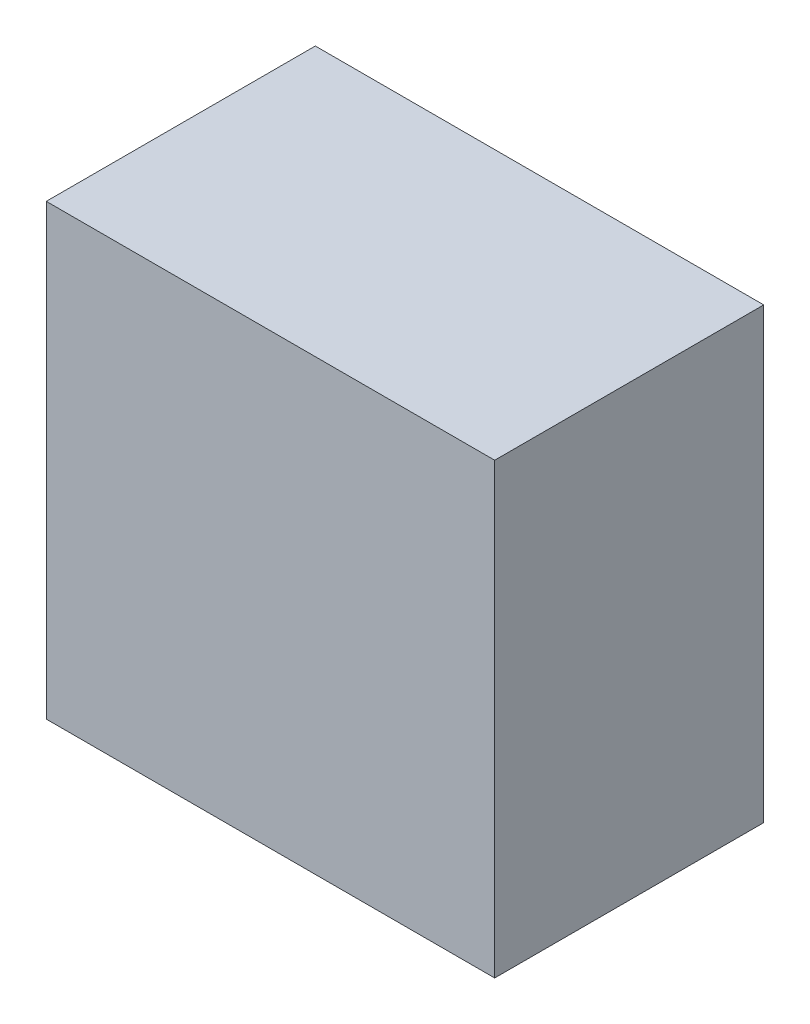
ISO-10303-21;
HEADER;
FILE_DESCRIPTION(('STEP AP214'),'2;1');
FILE_NAME('part.step','',(''),(''),'','','');
FILE_SCHEMA(('AUTOMOTIVE_DESIGN { 1 0 10303 214 1 1 1 1 }'));
ENDSEC;
DATA;
#1=APPLICATION_CONTEXT('core data for automotive mechanical design processes');
#2=APPLICATION_PROTOCOL_DEFINITION('international standard','automotive_design',2000,#1);
#3=PRODUCT_CONTEXT('',#1,'mechanical');
#4=PRODUCT('Part','Part','',(#3));
#5=PRODUCT_RELATED_PRODUCT_CATEGORY('part','',(#4));
#6=PRODUCT_DEFINITION_FORMATION('','',#4);
#7=PRODUCT_DEFINITION_CONTEXT('part definition',#1,'design');
#8=PRODUCT_DEFINITION('design','',#6,#7);
#9=PRODUCT_DEFINITION_SHAPE('','',#8);
#10=(LENGTH_UNIT() NAMED_UNIT(*) SI_UNIT(.MILLI.,.METRE.));
#11=(NAMED_UNIT(*) PLANE_ANGLE_UNIT() SI_UNIT($,.RADIAN.));
#12=(NAMED_UNIT(*) SI_UNIT($,.STERADIAN.) SOLID_ANGLE_UNIT());
#13=UNCERTAINTY_MEASURE_WITH_UNIT(LENGTH_MEASURE(1.E-05),#10,'distance_accuracy_value','');
#14=(GEOMETRIC_REPRESENTATION_CONTEXT(3) GLOBAL_UNCERTAINTY_ASSIGNED_CONTEXT((#13)) GLOBAL_UNIT_ASSIGNED_CONTEXT((#10,
#11,#12)) REPRESENTATION_CONTEXT('',''));
#15=CARTESIAN_POINT('',(0.,0.,0.));
#16=DIRECTION('',(0.,0.,1.));
#17=DIRECTION('',(1.,0.,0.));
#18=AXIS2_PLACEMENT_3D('',#15,#16,#17);
#19=CARTESIAN_POINT('',(-10.,10.,12.));
#20=DIRECTION('',(1.,0.,0.));
#21=DIRECTION('',(0.,0.,-1.));
#22=AXIS2_PLACEMENT_3D('',#19,#20,#21);
#23=PLANE('',#22);
#24=DIRECTION('',(0.,-1.,0.));
#25=VECTOR('',#24,1.);
#26=CARTESIAN_POINT('',(-10.,10.,0.));
#27=LINE('',#26,#25);
#28=CARTESIAN_POINT('',(-10.,10.,0.));
#29=VERTEX_POINT('',#28);
#30=CARTESIAN_POINT('',(-10.,-10.,0.));
#31=VERTEX_POINT('',#30);
#32=EDGE_CURVE('E158',#29,#31,#27,.T.);
#33=ORIENTED_EDGE('',*,*,#32,.T.);
#34=DIRECTION('',(0.,0.,-1.));
#35=VECTOR('',#34,1.);
#36=CARTESIAN_POINT('',(-10.,-10.,12.));
#37=LINE('',#36,#35);
#38=CARTESIAN_POINT('',(-10.,-10.,12.));
#39=VERTEX_POINT('',#38);
#40=EDGE_CURVE('E11',#39,#31,#37,.T.);
#41=ORIENTED_EDGE('',*,*,#40,.F.);
#42=DIRECTION('',(0.,-1.,0.));
#43=VECTOR('',#42,1.);
#44=CARTESIAN_POINT('',(-10.,10.,12.));
#45=LINE('',#44,#43);
#46=CARTESIAN_POINT('',(-10.,10.,12.));
#47=VERTEX_POINT('',#46);
#48=EDGE_CURVE('E164',#47,#39,#45,.T.);
#49=ORIENTED_EDGE('',*,*,#48,.F.);
#50=DIRECTION('',(0.,0.,-1.));
#51=VECTOR('',#50,1.);
#52=CARTESIAN_POINT('',(-10.,10.,12.));
#53=LINE('',#52,#51);
#54=EDGE_CURVE('E174',#47,#29,#53,.T.);
#55=ORIENTED_EDGE('',*,*,#54,.T.);
#56=EDGE_LOOP('',(#33,#41,#49,#55));
#57=FACE_BOUND('',#56,.T.);
#58=ADVANCED_FACE('F39',(#57),#23,.F.);
#59=CARTESIAN_POINT('',(-10.,-10.,12.));
#60=DIRECTION('',(0.,1.,0.));
#61=DIRECTION('',(0.,0.,1.));
#62=AXIS2_PLACEMENT_3D('',#59,#60,#61);
#63=PLANE('',#62);
#64=DIRECTION('',(1.,0.,0.));
#65=VECTOR('',#64,1.);
#66=CARTESIAN_POINT('',(-10.,-10.,0.));
#67=LINE('',#66,#65);
#68=CARTESIAN_POINT('',(10.,-10.,0.));
#69=VERTEX_POINT('',#68);
#70=EDGE_CURVE('E178',#31,#69,#67,.T.);
#71=ORIENTED_EDGE('',*,*,#70,.T.);
#72=DIRECTION('',(0.,0.,-1.));
#73=VECTOR('',#72,1.);
#74=CARTESIAN_POINT('',(10.,-10.,12.));
#75=LINE('',#74,#73);
#76=CARTESIAN_POINT('',(10.,-10.,12.));
#77=VERTEX_POINT('',#76);
#78=EDGE_CURVE('E47',#77,#69,#75,.T.);
#79=ORIENTED_EDGE('',*,*,#78,.F.);
#80=DIRECTION('',(1.,0.,0.));
#81=VECTOR('',#80,1.);
#82=CARTESIAN_POINT('',(-10.,-10.,12.));
#83=LINE('',#82,#81);
#84=EDGE_CURVE('E91',#39,#77,#83,.T.);
#85=ORIENTED_EDGE('',*,*,#84,.F.);
#86=ORIENTED_EDGE('',*,*,#40,.T.);
#87=EDGE_LOOP('',(#71,#79,#85,#86));
#88=FACE_BOUND('',#87,.T.);
#89=ADVANCED_FACE('F212',(#88),#63,.F.);
#90=CARTESIAN_POINT('',(10.,10.,12.));
#91=DIRECTION('',(-1.,0.,0.));
#92=DIRECTION('',(0.,-1.,0.));
#93=AXIS2_PLACEMENT_3D('',#90,#91,#92);
#94=PLANE('',#93);
#95=DIRECTION('',(0.,1.,0.));
#96=VECTOR('',#95,1.);
#97=CARTESIAN_POINT('',(10.,10.,0.));
#98=LINE('',#97,#96);
#99=CARTESIAN_POINT('',(10.,10.,0.));
#100=VERTEX_POINT('',#99);
#101=EDGE_CURVE('E181',#69,#100,#98,.T.);
#102=ORIENTED_EDGE('',*,*,#101,.T.);
#103=DIRECTION('',(0.,0.,-1.));
#104=VECTOR('',#103,1.);
#105=CARTESIAN_POINT('',(10.,10.,12.));
#106=LINE('',#105,#104);
#107=CARTESIAN_POINT('',(10.,10.,12.));
#108=VERTEX_POINT('',#107);
#109=EDGE_CURVE('E188',#108,#100,#106,.T.);
#110=ORIENTED_EDGE('',*,*,#109,.F.);
#111=DIRECTION('',(0.,1.,0.));
#112=VECTOR('',#111,1.);
#113=CARTESIAN_POINT('',(10.,10.,12.));
#114=LINE('',#113,#112);
#115=EDGE_CURVE('E169',#77,#108,#114,.T.);
#116=ORIENTED_EDGE('',*,*,#115,.F.);
#117=ORIENTED_EDGE('',*,*,#78,.T.);
#118=EDGE_LOOP('',(#102,#110,#116,#117));
#119=FACE_BOUND('',#118,.T.);
#120=ADVANCED_FACE('F195',(#119),#94,.F.);
#121=CARTESIAN_POINT('',(-10.,10.,12.));
#122=DIRECTION('',(0.,-1.,0.));
#123=DIRECTION('',(0.,0.,-1.));
#124=AXIS2_PLACEMENT_3D('',#121,#122,#123);
#125=PLANE('',#124);
#126=DIRECTION('',(-1.,0.,0.));
#127=VECTOR('',#126,1.);
#128=CARTESIAN_POINT('',(-10.,10.,0.));
#129=LINE('',#128,#127);
#130=EDGE_CURVE('E84',#100,#29,#129,.T.);
#131=ORIENTED_EDGE('',*,*,#130,.T.);
#132=ORIENTED_EDGE('',*,*,#54,.F.);
#133=DIRECTION('',(-1.,0.,0.));
#134=VECTOR('',#133,1.);
#135=CARTESIAN_POINT('',(-10.,10.,12.));
#136=LINE('',#135,#134);
#137=EDGE_CURVE('E63',#108,#47,#136,.T.);
#138=ORIENTED_EDGE('',*,*,#137,.F.);
#139=ORIENTED_EDGE('',*,*,#109,.T.);
#140=EDGE_LOOP('',(#131,#132,#138,#139));
#141=FACE_BOUND('',#140,.T.);
#142=ADVANCED_FACE('F203',(#141),#125,.F.);
#143=CARTESIAN_POINT('',(0.,0.,12.));
#144=DIRECTION('',(0.,0.,1.));
#145=DIRECTION('',(1.,0.,0.));
#146=AXIS2_PLACEMENT_3D('',#143,#144,#145);
#147=PLANE('',#146);
#148=ORIENTED_EDGE('',*,*,#48,.T.);
#149=ORIENTED_EDGE('',*,*,#84,.T.);
#150=ORIENTED_EDGE('',*,*,#115,.T.);
#151=ORIENTED_EDGE('',*,*,#137,.T.);
#152=EDGE_LOOP('',(#148,#149,#150,#151));
#153=FACE_BOUND('',#152,.T.);
#154=ADVANCED_FACE('F205',(#153),#147,.T.);
#155=CARTESIAN_POINT('',(0.,0.,0.));
#156=DIRECTION('',(0.,0.,1.));
#157=DIRECTION('',(1.,0.,0.));
#158=AXIS2_PLACEMENT_3D('',#155,#156,#157);
#159=PLANE('',#158);
#160=DIRECTION('',(-1.,0.,0.));
#161=VECTOR('',#160,1.);
#162=CARTESIAN_POINT('',(9.,-9.,0.));
#163=LINE('',#162,#161);
#164=CARTESIAN_POINT('',(9.,-9.,0.));
#165=VERTEX_POINT('',#164);
#166=CARTESIAN_POINT('',(-9.,-9.,0.));
#167=VERTEX_POINT('',#166);
#168=EDGE_CURVE('E149',#165,#167,#163,.T.);
#169=ORIENTED_EDGE('',*,*,#168,.F.);
#170=DIRECTION('',(0.,-1.,0.));
#171=VECTOR('',#170,1.);
#172=CARTESIAN_POINT('',(9.,9.,0.));
#173=LINE('',#172,#171);
#174=CARTESIAN_POINT('',(9.,9.,0.));
#175=VERTEX_POINT('',#174);
#176=EDGE_CURVE('E54',#175,#165,#173,.T.);
#177=ORIENTED_EDGE('',*,*,#176,.F.);
#178=DIRECTION('',(1.,0.,0.));
#179=VECTOR('',#178,1.);
#180=CARTESIAN_POINT('',(9.,9.,0.));
#181=LINE('',#180,#179);
#182=CARTESIAN_POINT('',(-9.,9.,0.));
#183=VERTEX_POINT('',#182);
#184=EDGE_CURVE('E136',#183,#175,#181,.T.);
#185=ORIENTED_EDGE('',*,*,#184,.F.);
#186=DIRECTION('',(0.,1.,0.));
#187=VECTOR('',#186,1.);
#188=CARTESIAN_POINT('',(-9.,9.,0.));
#189=LINE('',#188,#187);
#190=EDGE_CURVE('E140',#167,#183,#189,.T.);
#191=ORIENTED_EDGE('',*,*,#190,.F.);
#192=EDGE_LOOP('',(#169,#177,#185,#191));
#193=FACE_BOUND('',#192,.T.);
#194=ORIENTED_EDGE('',*,*,#32,.F.);
#195=ORIENTED_EDGE('',*,*,#130,.F.);
#196=ORIENTED_EDGE('',*,*,#101,.F.);
#197=ORIENTED_EDGE('',*,*,#70,.F.);
#198=EDGE_LOOP('',(#194,#195,#196,#197));
#199=FACE_BOUND('',#198,.T.);
#200=ADVANCED_FACE('F199',(#193,#199),#159,.F.);
#201=CARTESIAN_POINT('',(9.,9.,10.));
#202=DIRECTION('',(1.,0.,0.));
#203=DIRECTION('',(0.,1.,0.));
#204=AXIS2_PLACEMENT_3D('',#201,#202,#203);
#205=PLANE('',#204);
#206=ORIENTED_EDGE('',*,*,#176,.T.);
#207=DIRECTION('',(0.,0.,-1.));
#208=VECTOR('',#207,1.);
#209=CARTESIAN_POINT('',(9.,-9.,10.));
#210=LINE('',#209,#208);
#211=CARTESIAN_POINT('',(9.,-9.,10.));
#212=VERTEX_POINT('',#211);
#213=EDGE_CURVE('E111',#212,#165,#210,.T.);
#214=ORIENTED_EDGE('',*,*,#213,.F.);
#215=DIRECTION('',(0.,-1.,0.));
#216=VECTOR('',#215,1.);
#217=CARTESIAN_POINT('',(9.,9.,10.));
#218=LINE('',#217,#216);
#219=CARTESIAN_POINT('',(9.,9.,10.));
#220=VERTEX_POINT('',#219);
#221=EDGE_CURVE('E115',#220,#212,#218,.T.);
#222=ORIENTED_EDGE('',*,*,#221,.F.);
#223=DIRECTION('',(0.,0.,-1.));
#224=VECTOR('',#223,1.);
#225=CARTESIAN_POINT('',(9.,9.,10.));
#226=LINE('',#225,#224);
#227=EDGE_CURVE('E155',#220,#175,#226,.T.);
#228=ORIENTED_EDGE('',*,*,#227,.T.);
#229=EDGE_LOOP('',(#206,#214,#222,#228));
#230=FACE_BOUND('',#229,.T.);
#231=ADVANCED_FACE('F113',(#230),#205,.F.);
#232=CARTESIAN_POINT('',(9.,9.,10.));
#233=DIRECTION('',(0.,1.,0.));
#234=DIRECTION('',(0.,0.,1.));
#235=AXIS2_PLACEMENT_3D('',#232,#233,#234);
#236=PLANE('',#235);
#237=ORIENTED_EDGE('',*,*,#184,.T.);
#238=ORIENTED_EDGE('',*,*,#227,.F.);
#239=DIRECTION('',(1.,0.,0.));
#240=VECTOR('',#239,1.);
#241=CARTESIAN_POINT('',(9.,9.,10.));
#242=LINE('',#241,#240);
#243=CARTESIAN_POINT('',(-9.,9.,10.));
#244=VERTEX_POINT('',#243);
#245=EDGE_CURVE('E122',#244,#220,#242,.T.);
#246=ORIENTED_EDGE('',*,*,#245,.F.);
#247=DIRECTION('',(0.,0.,-1.));
#248=VECTOR('',#247,1.);
#249=CARTESIAN_POINT('',(-9.,9.,10.));
#250=LINE('',#249,#248);
#251=EDGE_CURVE('E159',#244,#183,#250,.T.);
#252=ORIENTED_EDGE('',*,*,#251,.T.);
#253=EDGE_LOOP('',(#237,#238,#246,#252));
#254=FACE_BOUND('',#253,.T.);
#255=ADVANCED_FACE('F252',(#254),#236,.F.);
#256=CARTESIAN_POINT('',(-9.,9.,10.));
#257=DIRECTION('',(-1.,0.,0.));
#258=DIRECTION('',(0.,-1.,0.));
#259=AXIS2_PLACEMENT_3D('',#256,#257,#258);
#260=PLANE('',#259);
#261=ORIENTED_EDGE('',*,*,#190,.T.);
#262=ORIENTED_EDGE('',*,*,#251,.F.);
#263=DIRECTION('',(0.,1.,0.));
#264=VECTOR('',#263,1.);
#265=CARTESIAN_POINT('',(-9.,9.,10.));
#266=LINE('',#265,#264);
#267=CARTESIAN_POINT('',(-9.,-9.,10.));
#268=VERTEX_POINT('',#267);
#269=EDGE_CURVE('E131',#268,#244,#266,.T.);
#270=ORIENTED_EDGE('',*,*,#269,.F.);
#271=DIRECTION('',(0.,0.,-1.));
#272=VECTOR('',#271,1.);
#273=CARTESIAN_POINT('',(-9.,-9.,10.));
#274=LINE('',#273,#272);
#275=EDGE_CURVE('E121',#268,#167,#274,.T.);
#276=ORIENTED_EDGE('',*,*,#275,.T.);
#277=EDGE_LOOP('',(#261,#262,#270,#276));
#278=FACE_BOUND('',#277,.T.);
#279=ADVANCED_FACE('F261',(#278),#260,.F.);
#280=CARTESIAN_POINT('',(9.,-9.,10.));
#281=DIRECTION('',(0.,-1.,0.));
#282=DIRECTION('',(0.,0.,-1.));
#283=AXIS2_PLACEMENT_3D('',#280,#281,#282);
#284=PLANE('',#283);
#285=ORIENTED_EDGE('',*,*,#168,.T.);
#286=ORIENTED_EDGE('',*,*,#275,.F.);
#287=DIRECTION('',(-1.,0.,0.));
#288=VECTOR('',#287,1.);
#289=CARTESIAN_POINT('',(9.,-9.,10.));
#290=LINE('',#289,#288);
#291=EDGE_CURVE('E125',#212,#268,#290,.T.);
#292=ORIENTED_EDGE('',*,*,#291,.F.);
#293=ORIENTED_EDGE('',*,*,#213,.T.);
#294=EDGE_LOOP('',(#285,#286,#292,#293));
#295=FACE_BOUND('',#294,.T.);
#296=ADVANCED_FACE('F126',(#295),#284,.F.);
#297=CARTESIAN_POINT('',(0.,0.,10.));
#298=DIRECTION('',(0.,0.,-1.));
#299=DIRECTION('',(-1.,0.,0.));
#300=AXIS2_PLACEMENT_3D('',#297,#298,#299);
#301=PLANE('',#300);
#302=ORIENTED_EDGE('',*,*,#221,.T.);
#303=ORIENTED_EDGE('',*,*,#291,.T.);
#304=ORIENTED_EDGE('',*,*,#269,.T.);
#305=ORIENTED_EDGE('',*,*,#245,.T.);
#306=EDGE_LOOP('',(#302,#303,#304,#305));
#307=FACE_BOUND('',#306,.T.);
#308=ADVANCED_FACE('F133',(#307),#301,.T.);
#309=CLOSED_SHELL('',(#58,#89,#120,#142,#154,#200,#231,#255,#279,#296,#308));
#310=MANIFOLD_SOLID_BREP('B2',#309);
#311=ADVANCED_BREP_SHAPE_REPRESENTATION('',(#18,#310),#14);
#312=SHAPE_DEFINITION_REPRESENTATION(#9,#311);
ENDSEC;
END-ISO-10303-21;
